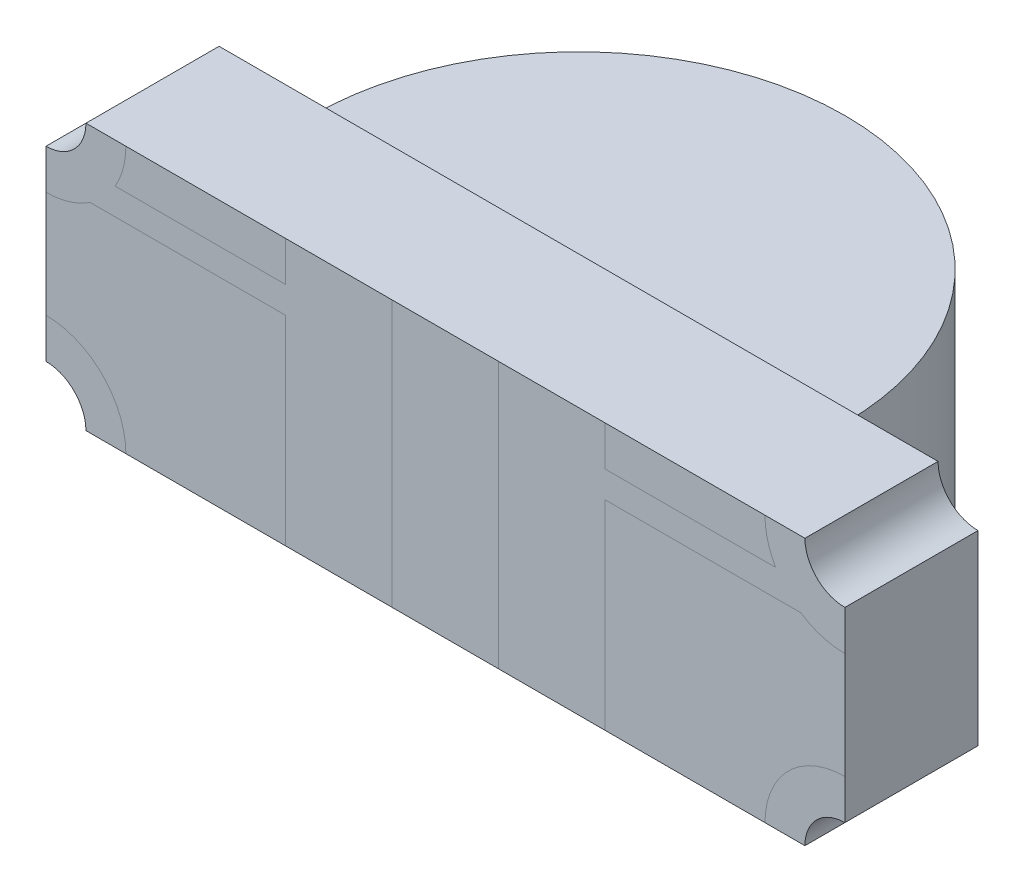
ISO-10303-21;
HEADER;
FILE_DESCRIPTION(('STEP AP214'),'2;1');
FILE_NAME('part.step','',(''),(''),'','','');
FILE_SCHEMA(('AUTOMOTIVE_DESIGN { 1 0 10303 214 1 1 1 1 }'));
ENDSEC;
DATA;
#1=APPLICATION_CONTEXT('core data for automotive mechanical design processes');
#2=APPLICATION_PROTOCOL_DEFINITION('international standard','automotive_design',2000,#1);
#3=PRODUCT_CONTEXT('',#1,'mechanical');
#4=PRODUCT('Part','Part','',(#3));
#5=PRODUCT_RELATED_PRODUCT_CATEGORY('part','',(#4));
#6=PRODUCT_DEFINITION_FORMATION('','',#4);
#7=PRODUCT_DEFINITION_CONTEXT('part definition',#1,'design');
#8=PRODUCT_DEFINITION('design','',#6,#7);
#9=PRODUCT_DEFINITION_SHAPE('','',#8);
#10=(LENGTH_UNIT() NAMED_UNIT(*) SI_UNIT(.MILLI.,.METRE.));
#11=(NAMED_UNIT(*) PLANE_ANGLE_UNIT() SI_UNIT($,.RADIAN.));
#12=(NAMED_UNIT(*) SI_UNIT($,.STERADIAN.) SOLID_ANGLE_UNIT());
#13=UNCERTAINTY_MEASURE_WITH_UNIT(LENGTH_MEASURE(1.E-05),#10,'distance_accuracy_value','');
#14=(GEOMETRIC_REPRESENTATION_CONTEXT(3) GLOBAL_UNCERTAINTY_ASSIGNED_CONTEXT((#13)) GLOBAL_UNIT_ASSIGNED_CONTEXT((#10,
#11,#12)) REPRESENTATION_CONTEXT('',''));
#15=CARTESIAN_POINT('',(0.,0.,0.));
#16=DIRECTION('',(0.,0.,1.));
#17=DIRECTION('',(1.,0.,0.));
#18=AXIS2_PLACEMENT_3D('',#15,#16,#17);
#19=CARTESIAN_POINT('',(0.,1.,-0.5));
#20=DIRECTION('',(0.,-1.,0.));
#21=DIRECTION('',(0.,0.,-1.));
#22=AXIS2_PLACEMENT_3D('',#19,#20,#21);
#23=CYLINDRICAL_SURFACE('',#22,1.);
#24=CARTESIAN_POINT('',(0.,0.95,-0.5));
#25=DIRECTION('',(0.,1.,0.));
#26=DIRECTION('',(0.,0.,1.));
#27=AXIS2_PLACEMENT_3D('',#24,#25,#26);
#28=CIRCLE('',#27,1.);
#29=CARTESIAN_POINT('',(1.,0.95,-0.5));
#30=VERTEX_POINT('',#29);
#31=CARTESIAN_POINT('',(-1.,0.95,-0.5));
#32=VERTEX_POINT('',#31);
#33=EDGE_CURVE('E183',#30,#32,#28,.T.);
#34=ORIENTED_EDGE('',*,*,#33,.F.);
#35=DIRECTION('',(0.,-1.,0.));
#36=VECTOR('',#35,1.);
#37=CARTESIAN_POINT('',(1.,1.,-0.5));
#38=LINE('',#37,#36);
#39=CARTESIAN_POINT('',(1.,0.,-0.5));
#40=VERTEX_POINT('',#39);
#41=EDGE_CURVE('E197',#30,#40,#38,.T.);
#42=ORIENTED_EDGE('',*,*,#41,.T.);
#43=CARTESIAN_POINT('',(0.,0.,-0.5));
#44=DIRECTION('',(0.,1.,0.));
#45=DIRECTION('',(0.,0.,1.));
#46=AXIS2_PLACEMENT_3D('',#43,#44,#45);
#47=CIRCLE('',#46,1.);
#48=CARTESIAN_POINT('',(-1.,0.,-0.5));
#49=VERTEX_POINT('',#48);
#50=EDGE_CURVE('E201',#40,#49,#47,.T.);
#51=ORIENTED_EDGE('',*,*,#50,.T.);
#52=DIRECTION('',(0.,-1.,0.));
#53=VECTOR('',#52,1.);
#54=CARTESIAN_POINT('',(-1.,1.,-0.5));
#55=LINE('',#54,#53);
#56=EDGE_CURVE('E194',#32,#49,#55,.T.);
#57=ORIENTED_EDGE('',*,*,#56,.F.);
#58=EDGE_LOOP('',(#34,#42,#51,#57));
#59=FACE_BOUND('',#58,.T.);
#60=ADVANCED_FACE('F37',(#59),#23,.T.);
#61=CARTESIAN_POINT('',(-1.5,1.,0.));
#62=DIRECTION('',(0.,0.,-1.));
#63=DIRECTION('',(-1.,0.,0.));
#64=AXIS2_PLACEMENT_3D('',#61,#62,#63);
#65=PLANE('',#64);
#66=CARTESIAN_POINT('',(1.5,1.,0.));
#67=DIRECTION('',(0.,0.,-1.));
#68=DIRECTION('',(-1.,0.,0.));
#69=AXIS2_PLACEMENT_3D('',#66,#67,#68);
#70=CIRCLE('',#69,0.3);
#71=CARTESIAN_POINT('',(1.2,1.,0.));
#72=VERTEX_POINT('',#71);
#73=CARTESIAN_POINT('',(1.24019237886467,0.85,0.));
#74=VERTEX_POINT('',#73);
#75=EDGE_CURVE('E11',#72,#74,#70,.F.);
#76=ORIENTED_EDGE('',*,*,#75,.F.);
#77=DIRECTION('',(1.,0.,0.));
#78=VECTOR('',#77,1.);
#79=CARTESIAN_POINT('',(-1.5,1.,0.));
#80=LINE('',#79,#78);
#81=CARTESIAN_POINT('',(0.6,1.,0.));
#82=VERTEX_POINT('',#81);
#83=EDGE_CURVE('E339',#82,#72,#80,.T.);
#84=ORIENTED_EDGE('',*,*,#83,.F.);
#85=DIRECTION('',(0.,1.,0.));
#86=VECTOR('',#85,1.);
#87=CARTESIAN_POINT('',(0.6,1.,0.));
#88=LINE('',#87,#86);
#89=CARTESIAN_POINT('',(0.6,0.85,0.));
#90=VERTEX_POINT('',#89);
#91=EDGE_CURVE('E273',#90,#82,#88,.T.);
#92=ORIENTED_EDGE('',*,*,#91,.F.);
#93=DIRECTION('',(-1.,0.,0.));
#94=VECTOR('',#93,1.);
#95=CARTESIAN_POINT('',(-1.5,0.85,0.));
#96=LINE('',#95,#94);
#97=EDGE_CURVE('E41',#74,#90,#96,.T.);
#98=ORIENTED_EDGE('',*,*,#97,.F.);
#99=EDGE_LOOP('',(#76,#84,#92,#98));
#100=FACE_BOUND('',#99,.T.);
#101=ADVANCED_FACE('F441',(#100),#65,.F.);
#102=DIRECTION('',(0.,-1.,0.));
#103=VECTOR('',#102,1.);
#104=CARTESIAN_POINT('',(0.2,1.,0.));
#105=LINE('',#104,#103);
#106=CARTESIAN_POINT('',(0.2,1.,0.));
#107=VERTEX_POINT('',#106);
#108=CARTESIAN_POINT('',(0.2,0.,0.));
#109=VERTEX_POINT('',#108);
#110=EDGE_CURVE('E271',#107,#109,#105,.T.);
#111=ORIENTED_EDGE('',*,*,#110,.F.);
#112=CARTESIAN_POINT('',(-0.2,1.,0.));
#113=VERTEX_POINT('',#112);
#114=EDGE_CURVE('E355',#113,#107,#80,.T.);
#115=ORIENTED_EDGE('',*,*,#114,.F.);
#116=DIRECTION('',(0.,1.,0.));
#117=VECTOR('',#116,1.);
#118=CARTESIAN_POINT('',(-0.2,1.,0.));
#119=LINE('',#118,#117);
#120=CARTESIAN_POINT('',(-0.2,0.,0.));
#121=VERTEX_POINT('',#120);
#122=EDGE_CURVE('E253',#121,#113,#119,.T.);
#123=ORIENTED_EDGE('',*,*,#122,.F.);
#124=DIRECTION('',(1.,0.,0.));
#125=VECTOR('',#124,1.);
#126=CARTESIAN_POINT('',(-1.5,0.,0.));
#127=LINE('',#126,#125);
#128=EDGE_CURVE('E325',#121,#109,#127,.T.);
#129=ORIENTED_EDGE('',*,*,#128,.T.);
#130=EDGE_LOOP('',(#111,#115,#123,#129));
#131=FACE_BOUND('',#130,.T.);
#132=ADVANCED_FACE('F366',(#131),#65,.F.);
#133=CARTESIAN_POINT('',(1.33416876048223,0.75,0.));
#134=VERTEX_POINT('',#133);
#135=CARTESIAN_POINT('',(1.5,0.7,0.));
#136=VERTEX_POINT('',#135);
#137=EDGE_CURVE('E48',#134,#136,#70,.F.);
#138=ORIENTED_EDGE('',*,*,#137,.F.);
#139=DIRECTION('',(1.,0.,0.));
#140=VECTOR('',#139,1.);
#141=CARTESIAN_POINT('',(-1.5,0.75,0.));
#142=LINE('',#141,#140);
#143=CARTESIAN_POINT('',(0.6,0.75,0.));
#144=VERTEX_POINT('',#143);
#145=EDGE_CURVE('E263',#144,#134,#142,.T.);
#146=ORIENTED_EDGE('',*,*,#145,.F.);
#147=DIRECTION('',(0.,1.,0.));
#148=VECTOR('',#147,1.);
#149=CARTESIAN_POINT('',(0.6,1.,0.));
#150=LINE('',#149,#148);
#151=CARTESIAN_POINT('',(0.6,0.,0.));
#152=VERTEX_POINT('',#151);
#153=EDGE_CURVE('E267',#152,#144,#150,.T.);
#154=ORIENTED_EDGE('',*,*,#153,.F.);
#155=CARTESIAN_POINT('',(1.2,0.,0.));
#156=VERTEX_POINT('',#155);
#157=EDGE_CURVE('E333',#152,#156,#127,.T.);
#158=ORIENTED_EDGE('',*,*,#157,.T.);
#159=CARTESIAN_POINT('',(1.5,0.,0.));
#160=DIRECTION('',(0.,0.,-1.));
#161=DIRECTION('',(-1.,0.,0.));
#162=AXIS2_PLACEMENT_3D('',#159,#160,#161);
#163=CIRCLE('',#162,0.3);
#164=CARTESIAN_POINT('',(1.5,0.3,0.));
#165=VERTEX_POINT('',#164);
#166=EDGE_CURVE('E235',#165,#156,#163,.F.);
#167=ORIENTED_EDGE('',*,*,#166,.F.);
#168=DIRECTION('',(0.,-1.,0.));
#169=VECTOR('',#168,1.);
#170=CARTESIAN_POINT('',(1.5,1.,0.));
#171=LINE('',#170,#169);
#172=EDGE_CURVE('E219',#136,#165,#171,.T.);
#173=ORIENTED_EDGE('',*,*,#172,.F.);
#174=EDGE_LOOP('',(#138,#146,#154,#158,#167,#173));
#175=FACE_BOUND('',#174,.T.);
#176=ADVANCED_FACE('F417',(#175),#65,.F.);
#177=CARTESIAN_POINT('',(-1.5,1.,0.));
#178=DIRECTION('',(0.,0.,-1.));
#179=DIRECTION('',(-1.,0.,0.));
#180=AXIS2_PLACEMENT_3D('',#177,#178,#179);
#181=CIRCLE('',#180,0.3);
#182=CARTESIAN_POINT('',(-1.5,0.699999999999999,0.));
#183=VERTEX_POINT('',#182);
#184=CARTESIAN_POINT('',(-1.33416876048223,0.75,0.));
#185=VERTEX_POINT('',#184);
#186=EDGE_CURVE('E254',#183,#185,#181,.F.);
#187=ORIENTED_EDGE('',*,*,#186,.F.);
#188=DIRECTION('',(0.,-1.,0.));
#189=VECTOR('',#188,1.);
#190=CARTESIAN_POINT('',(-1.5,1.,0.));
#191=LINE('',#190,#189);
#192=CARTESIAN_POINT('',(-1.5,0.3,0.));
#193=VERTEX_POINT('',#192);
#194=EDGE_CURVE('E224',#183,#193,#191,.T.);
#195=ORIENTED_EDGE('',*,*,#194,.T.);
#196=CARTESIAN_POINT('',(-1.5,0.,0.));
#197=DIRECTION('',(0.,0.,-1.));
#198=DIRECTION('',(-1.,0.,0.));
#199=AXIS2_PLACEMENT_3D('',#196,#197,#198);
#200=CIRCLE('',#199,0.3);
#201=CARTESIAN_POINT('',(-1.2,0.,0.));
#202=VERTEX_POINT('',#201);
#203=EDGE_CURVE('E239',#202,#193,#200,.F.);
#204=ORIENTED_EDGE('',*,*,#203,.F.);
#205=CARTESIAN_POINT('',(-0.6,0.,0.));
#206=VERTEX_POINT('',#205);
#207=EDGE_CURVE('E314',#202,#206,#127,.T.);
#208=ORIENTED_EDGE('',*,*,#207,.T.);
#209=DIRECTION('',(0.,-1.,0.));
#210=VECTOR('',#209,1.);
#211=CARTESIAN_POINT('',(-0.600000000000001,1.,0.));
#212=LINE('',#211,#210);
#213=CARTESIAN_POINT('',(-0.600000000000001,0.75,0.));
#214=VERTEX_POINT('',#213);
#215=EDGE_CURVE('E257',#214,#206,#212,.T.);
#216=ORIENTED_EDGE('',*,*,#215,.F.);
#217=DIRECTION('',(1.,0.,0.));
#218=VECTOR('',#217,1.);
#219=CARTESIAN_POINT('',(-1.5,0.75,0.));
#220=LINE('',#219,#218);
#221=EDGE_CURVE('E260',#185,#214,#220,.T.);
#222=ORIENTED_EDGE('',*,*,#221,.F.);
#223=EDGE_LOOP('',(#187,#195,#204,#208,#216,#222));
#224=FACE_BOUND('',#223,.T.);
#225=ADVANCED_FACE('F311',(#224),#65,.F.);
#226=CARTESIAN_POINT('',(1.35,1.,0.));
#227=VERTEX_POINT('',#226);
#228=EDGE_CURVE('E337',#72,#227,#80,.T.);
#229=ORIENTED_EDGE('',*,*,#228,.F.);
#230=ORIENTED_EDGE('',*,*,#75,.T.);
#231=ORIENTED_EDGE('',*,*,#97,.T.);
#232=ORIENTED_EDGE('',*,*,#91,.T.);
#233=EDGE_CURVE('E344',#107,#82,#80,.T.);
#234=ORIENTED_EDGE('',*,*,#233,.F.);
#235=ORIENTED_EDGE('',*,*,#110,.T.);
#236=EDGE_CURVE('E329',#109,#152,#127,.T.);
#237=ORIENTED_EDGE('',*,*,#236,.T.);
#238=ORIENTED_EDGE('',*,*,#153,.T.);
#239=ORIENTED_EDGE('',*,*,#145,.T.);
#240=ORIENTED_EDGE('',*,*,#137,.T.);
#241=CARTESIAN_POINT('',(1.5,0.85,0.));
#242=VERTEX_POINT('',#241);
#243=EDGE_CURVE('E215',#242,#136,#171,.T.);
#244=ORIENTED_EDGE('',*,*,#243,.F.);
#245=CARTESIAN_POINT('',(1.5,1.,0.));
#246=DIRECTION('',(0.,0.,1.));
#247=DIRECTION('',(1.,0.,0.));
#248=AXIS2_PLACEMENT_3D('',#245,#246,#247);
#249=CIRCLE('',#248,0.15);
#250=EDGE_CURVE('E404',#227,#242,#249,.T.);
#251=ORIENTED_EDGE('',*,*,#250,.F.);
#252=EDGE_LOOP('',(#229,#230,#231,#232,#234,#235,#237,#238,#239,#240,#244,#251));
#253=FACE_BOUND('',#252,.T.);
#254=ADVANCED_FACE('F361',(#253),#65,.F.);
#255=CARTESIAN_POINT('',(-1.24019237886467,0.85,0.));
#256=VERTEX_POINT('',#255);
#257=CARTESIAN_POINT('',(-1.2,1.,0.));
#258=VERTEX_POINT('',#257);
#259=EDGE_CURVE('E250',#256,#258,#181,.F.);
#260=ORIENTED_EDGE('',*,*,#259,.F.);
#261=DIRECTION('',(-1.,0.,0.));
#262=VECTOR('',#261,1.);
#263=CARTESIAN_POINT('',(-1.5,0.85,0.));
#264=LINE('',#263,#262);
#265=CARTESIAN_POINT('',(-0.6,0.85,0.));
#266=VERTEX_POINT('',#265);
#267=EDGE_CURVE('E243',#266,#256,#264,.T.);
#268=ORIENTED_EDGE('',*,*,#267,.F.);
#269=DIRECTION('',(0.,-1.,0.));
#270=VECTOR('',#269,1.);
#271=CARTESIAN_POINT('',(-0.6,1.,0.));
#272=LINE('',#271,#270);
#273=CARTESIAN_POINT('',(-0.6,1.,0.));
#274=VERTEX_POINT('',#273);
#275=EDGE_CURVE('E247',#274,#266,#272,.T.);
#276=ORIENTED_EDGE('',*,*,#275,.F.);
#277=EDGE_CURVE('E347',#258,#274,#80,.T.);
#278=ORIENTED_EDGE('',*,*,#277,.F.);
#279=EDGE_LOOP('',(#260,#268,#276,#278));
#280=FACE_BOUND('',#279,.T.);
#281=ADVANCED_FACE('F369',(#280),#65,.F.);
#282=CARTESIAN_POINT('',(-1.5,0.85,0.));
#283=VERTEX_POINT('',#282);
#284=EDGE_CURVE('E220',#283,#183,#191,.T.);
#285=ORIENTED_EDGE('',*,*,#284,.T.);
#286=ORIENTED_EDGE('',*,*,#186,.T.);
#287=ORIENTED_EDGE('',*,*,#221,.T.);
#288=ORIENTED_EDGE('',*,*,#215,.T.);
#289=EDGE_CURVE('E317',#206,#121,#127,.T.);
#290=ORIENTED_EDGE('',*,*,#289,.T.);
#291=ORIENTED_EDGE('',*,*,#122,.T.);
#292=EDGE_CURVE('E352',#274,#113,#80,.T.);
#293=ORIENTED_EDGE('',*,*,#292,.F.);
#294=ORIENTED_EDGE('',*,*,#275,.T.);
#295=ORIENTED_EDGE('',*,*,#267,.T.);
#296=ORIENTED_EDGE('',*,*,#259,.T.);
#297=CARTESIAN_POINT('',(-1.35,1.,0.));
#298=VERTEX_POINT('',#297);
#299=EDGE_CURVE('E340',#298,#258,#80,.T.);
#300=ORIENTED_EDGE('',*,*,#299,.F.);
#301=CARTESIAN_POINT('',(-1.5,1.,0.));
#302=DIRECTION('',(0.,0.,1.));
#303=DIRECTION('',(1.,0.,0.));
#304=AXIS2_PLACEMENT_3D('',#301,#302,#303);
#305=CIRCLE('',#304,0.15);
#306=EDGE_CURVE('E370',#283,#298,#305,.T.);
#307=ORIENTED_EDGE('',*,*,#306,.F.);
#308=EDGE_LOOP('',(#285,#286,#287,#288,#290,#291,#293,#294,#295,#296,#300,#307));
#309=FACE_BOUND('',#308,.T.);
#310=ADVANCED_FACE('F305',(#309),#65,.F.);
#311=CARTESIAN_POINT('',(-1.35,0.,0.));
#312=VERTEX_POINT('',#311);
#313=EDGE_CURVE('E327',#312,#202,#127,.T.);
#314=ORIENTED_EDGE('',*,*,#313,.T.);
#315=ORIENTED_EDGE('',*,*,#203,.T.);
#316=CARTESIAN_POINT('',(-1.5,0.15,0.));
#317=VERTEX_POINT('',#316);
#318=EDGE_CURVE('E218',#193,#317,#191,.T.);
#319=ORIENTED_EDGE('',*,*,#318,.T.);
#320=CARTESIAN_POINT('',(-1.5,0.,0.));
#321=DIRECTION('',(0.,0.,1.));
#322=DIRECTION('',(1.,0.,0.));
#323=AXIS2_PLACEMENT_3D('',#320,#321,#322);
#324=CIRCLE('',#323,0.15);
#325=EDGE_CURVE('E198',#312,#317,#324,.T.);
#326=ORIENTED_EDGE('',*,*,#325,.F.);
#327=EDGE_LOOP('',(#314,#315,#319,#326));
#328=FACE_BOUND('',#327,.T.);
#329=ADVANCED_FACE('F384',(#328),#65,.F.);
#330=CARTESIAN_POINT('',(-1.5,1.,-0.5));
#331=DIRECTION('',(1.,0.,0.));
#332=DIRECTION('',(0.,0.,-1.));
#333=AXIS2_PLACEMENT_3D('',#330,#331,#332);
#334=PLANE('',#333);
#335=DIRECTION('',(0.,-1.,0.));
#336=VECTOR('',#335,1.);
#337=CARTESIAN_POINT('',(-1.5,1.,-0.5));
#338=LINE('',#337,#336);
#339=CARTESIAN_POINT('',(-1.5,0.85,-0.5));
#340=VERTEX_POINT('',#339);
#341=CARTESIAN_POINT('',(-1.5,0.15,-0.5));
#342=VERTEX_POINT('',#341);
#343=EDGE_CURVE('E203',#340,#342,#338,.T.);
#344=ORIENTED_EDGE('',*,*,#343,.T.);
#345=DIRECTION('',(0.,0.,1.));
#346=VECTOR('',#345,1.);
#347=CARTESIAN_POINT('',(-1.5,0.15,-1.5));
#348=LINE('',#347,#346);
#349=EDGE_CURVE('E373',#342,#317,#348,.T.);
#350=ORIENTED_EDGE('',*,*,#349,.T.);
#351=ORIENTED_EDGE('',*,*,#318,.F.);
#352=ORIENTED_EDGE('',*,*,#194,.F.);
#353=ORIENTED_EDGE('',*,*,#284,.F.);
#354=DIRECTION('',(0.,0.,1.));
#355=VECTOR('',#354,1.);
#356=CARTESIAN_POINT('',(-1.5,0.85,-1.5));
#357=LINE('',#356,#355);
#358=EDGE_CURVE('E377',#283,#340,#357,.F.);
#359=ORIENTED_EDGE('',*,*,#358,.T.);
#360=EDGE_LOOP('',(#344,#350,#351,#352,#353,#359));
#361=FACE_BOUND('',#360,.T.);
#362=ADVANCED_FACE('F39',(#361),#334,.F.);
#363=CARTESIAN_POINT('',(1.5,0.15,0.));
#364=VERTEX_POINT('',#363);
#365=EDGE_CURVE('E214',#165,#364,#171,.T.);
#366=ORIENTED_EDGE('',*,*,#365,.F.);
#367=ORIENTED_EDGE('',*,*,#166,.T.);
#368=CARTESIAN_POINT('',(1.35,0.,0.));
#369=VERTEX_POINT('',#368);
#370=EDGE_CURVE('E328',#156,#369,#127,.T.);
#371=ORIENTED_EDGE('',*,*,#370,.T.);
#372=CARTESIAN_POINT('',(1.5,0.,0.));
#373=DIRECTION('',(0.,0.,1.));
#374=DIRECTION('',(1.,0.,0.));
#375=AXIS2_PLACEMENT_3D('',#372,#373,#374);
#376=CIRCLE('',#375,0.15);
#377=EDGE_CURVE('E395',#364,#369,#376,.T.);
#378=ORIENTED_EDGE('',*,*,#377,.F.);
#379=EDGE_LOOP('',(#366,#367,#371,#378));
#380=FACE_BOUND('',#379,.T.);
#381=ADVANCED_FACE('F421',(#380),#65,.F.);
#382=CARTESIAN_POINT('',(1.5,1.,-0.5));
#383=DIRECTION('',(-1.,0.,0.));
#384=DIRECTION('',(0.,0.,1.));
#385=AXIS2_PLACEMENT_3D('',#382,#383,#384);
#386=PLANE('',#385);
#387=ORIENTED_EDGE('',*,*,#243,.T.);
#388=ORIENTED_EDGE('',*,*,#172,.T.);
#389=ORIENTED_EDGE('',*,*,#365,.T.);
#390=DIRECTION('',(0.,0.,1.));
#391=VECTOR('',#390,1.);
#392=CARTESIAN_POINT('',(1.5,0.15,-1.5));
#393=LINE('',#392,#391);
#394=CARTESIAN_POINT('',(1.5,0.15,-0.5));
#395=VERTEX_POINT('',#394);
#396=EDGE_CURVE('E401',#364,#395,#393,.F.);
#397=ORIENTED_EDGE('',*,*,#396,.T.);
#398=DIRECTION('',(0.,-1.,0.));
#399=VECTOR('',#398,1.);
#400=CARTESIAN_POINT('',(1.5,1.,-0.5));
#401=LINE('',#400,#399);
#402=CARTESIAN_POINT('',(1.5,0.85,-0.5));
#403=VERTEX_POINT('',#402);
#404=EDGE_CURVE('E205',#403,#395,#401,.T.);
#405=ORIENTED_EDGE('',*,*,#404,.F.);
#406=DIRECTION('',(0.,0.,1.));
#407=VECTOR('',#406,1.);
#408=CARTESIAN_POINT('',(1.5,0.85,-1.5));
#409=LINE('',#408,#407);
#410=EDGE_CURVE('E408',#403,#242,#409,.T.);
#411=ORIENTED_EDGE('',*,*,#410,.T.);
#412=EDGE_LOOP('',(#387,#388,#389,#397,#405,#411));
#413=FACE_BOUND('',#412,.T.);
#414=ADVANCED_FACE('F427',(#413),#386,.F.);
#415=CARTESIAN_POINT('',(-1.5,1.,-0.5));
#416=DIRECTION('',(0.,0.,1.));
#417=DIRECTION('',(1.,0.,0.));
#418=AXIS2_PLACEMENT_3D('',#415,#416,#417);
#419=PLANE('',#418);
#420=DIRECTION('',(-1.,0.,0.));
#421=VECTOR('',#420,1.);
#422=CARTESIAN_POINT('',(-1.5,0.,-0.5));
#423=LINE('',#422,#421);
#424=CARTESIAN_POINT('',(-1.35,0.,-0.5));
#425=VERTEX_POINT('',#424);
#426=EDGE_CURVE('E336',#49,#425,#423,.T.);
#427=ORIENTED_EDGE('',*,*,#426,.T.);
#428=CARTESIAN_POINT('',(-1.5,0.,-0.5));
#429=DIRECTION('',(0.,0.,1.));
#430=DIRECTION('',(1.,0.,0.));
#431=AXIS2_PLACEMENT_3D('',#428,#429,#430);
#432=CIRCLE('',#431,0.15);
#433=EDGE_CURVE('E387',#425,#342,#432,.T.);
#434=ORIENTED_EDGE('',*,*,#433,.T.);
#435=ORIENTED_EDGE('',*,*,#343,.F.);
#436=CARTESIAN_POINT('',(-1.5,1.,-0.5));
#437=DIRECTION('',(0.,0.,1.));
#438=DIRECTION('',(1.,0.,0.));
#439=AXIS2_PLACEMENT_3D('',#436,#437,#438);
#440=CIRCLE('',#439,0.15);
#441=CARTESIAN_POINT('',(-1.35,1.,-0.5));
#442=VERTEX_POINT('',#441);
#443=EDGE_CURVE('E372',#340,#442,#440,.T.);
#444=ORIENTED_EDGE('',*,*,#443,.T.);
#445=DIRECTION('',(-1.,0.,0.));
#446=VECTOR('',#445,1.);
#447=CARTESIAN_POINT('',(-1.5,1.,-0.5));
#448=LINE('',#447,#446);
#449=CARTESIAN_POINT('',(1.35,1.,-0.5));
#450=VERTEX_POINT('',#449);
#451=EDGE_CURVE('E208',#450,#442,#448,.T.);
#452=ORIENTED_EDGE('',*,*,#451,.F.);
#453=CARTESIAN_POINT('',(1.5,1.,-0.5));
#454=DIRECTION('',(0.,0.,1.));
#455=DIRECTION('',(1.,0.,0.));
#456=AXIS2_PLACEMENT_3D('',#453,#454,#455);
#457=CIRCLE('',#456,0.15);
#458=EDGE_CURVE('E406',#450,#403,#457,.T.);
#459=ORIENTED_EDGE('',*,*,#458,.T.);
#460=ORIENTED_EDGE('',*,*,#404,.T.);
#461=CARTESIAN_POINT('',(1.5,0.,-0.5));
#462=DIRECTION('',(0.,0.,1.));
#463=DIRECTION('',(1.,0.,0.));
#464=AXIS2_PLACEMENT_3D('',#461,#462,#463);
#465=CIRCLE('',#464,0.15);
#466=CARTESIAN_POINT('',(1.35,0.,-0.5));
#467=VERTEX_POINT('',#466);
#468=EDGE_CURVE('E398',#395,#467,#465,.T.);
#469=ORIENTED_EDGE('',*,*,#468,.T.);
#470=DIRECTION('',(-1.,0.,0.));
#471=VECTOR('',#470,1.);
#472=CARTESIAN_POINT('',(1.,0.,-0.5));
#473=LINE('',#472,#471);
#474=EDGE_CURVE('E332',#467,#40,#473,.T.);
#475=ORIENTED_EDGE('',*,*,#474,.T.);
#476=ORIENTED_EDGE('',*,*,#41,.F.);
#477=DIRECTION('',(1.,0.,0.));
#478=VECTOR('',#477,1.);
#479=CARTESIAN_POINT('',(1.,0.95,-0.5));
#480=LINE('',#479,#478);
#481=EDGE_CURVE('E186',#32,#30,#480,.T.);
#482=ORIENTED_EDGE('',*,*,#481,.F.);
#483=ORIENTED_EDGE('',*,*,#56,.T.);
#484=EDGE_LOOP('',(#427,#434,#435,#444,#452,#459,#460,#469,#475,#476,#482,#483));
#485=FACE_BOUND('',#484,.T.);
#486=ADVANCED_FACE('F193',(#485),#419,.F.);
#487=CARTESIAN_POINT('',(0.,1.,-0.5));
#488=DIRECTION('',(0.,1.,0.));
#489=DIRECTION('',(0.,0.,1.));
#490=AXIS2_PLACEMENT_3D('',#487,#488,#489);
#491=PLANE('',#490);
#492=DIRECTION('',(0.,0.,1.));
#493=VECTOR('',#492,1.);
#494=CARTESIAN_POINT('',(1.35,1.,-1.5));
#495=LINE('',#494,#493);
#496=EDGE_CURVE('E223',#450,#227,#495,.T.);
#497=ORIENTED_EDGE('',*,*,#496,.F.);
#498=ORIENTED_EDGE('',*,*,#451,.T.);
#499=DIRECTION('',(0.,0.,1.));
#500=VECTOR('',#499,1.);
#501=CARTESIAN_POINT('',(-1.35,1.,-1.5));
#502=LINE('',#501,#500);
#503=EDGE_CURVE('E230',#298,#442,#502,.F.);
#504=ORIENTED_EDGE('',*,*,#503,.F.);
#505=ORIENTED_EDGE('',*,*,#299,.T.);
#506=ORIENTED_EDGE('',*,*,#277,.T.);
#507=ORIENTED_EDGE('',*,*,#292,.T.);
#508=ORIENTED_EDGE('',*,*,#114,.T.);
#509=ORIENTED_EDGE('',*,*,#233,.T.);
#510=ORIENTED_EDGE('',*,*,#83,.T.);
#511=ORIENTED_EDGE('',*,*,#228,.T.);
#512=EDGE_LOOP('',(#497,#498,#504,#505,#506,#507,#508,#509,#510,#511));
#513=FACE_BOUND('',#512,.T.);
#514=ADVANCED_FACE('F360',(#513),#491,.T.);
#515=CARTESIAN_POINT('',(0.,0.,-0.5));
#516=DIRECTION('',(0.,1.,0.));
#517=DIRECTION('',(0.,0.,1.));
#518=AXIS2_PLACEMENT_3D('',#515,#516,#517);
#519=PLANE('',#518);
#520=ORIENTED_EDGE('',*,*,#313,.F.);
#521=DIRECTION('',(0.,0.,1.));
#522=VECTOR('',#521,1.);
#523=CARTESIAN_POINT('',(-1.35,0.,-1.5));
#524=LINE('',#523,#522);
#525=EDGE_CURVE('E232',#312,#425,#524,.F.);
#526=ORIENTED_EDGE('',*,*,#525,.T.);
#527=ORIENTED_EDGE('',*,*,#426,.F.);
#528=ORIENTED_EDGE('',*,*,#50,.F.);
#529=ORIENTED_EDGE('',*,*,#474,.F.);
#530=DIRECTION('',(0.,0.,1.));
#531=VECTOR('',#530,1.);
#532=CARTESIAN_POINT('',(1.35,0.,-1.5));
#533=LINE('',#532,#531);
#534=EDGE_CURVE('E227',#467,#369,#533,.T.);
#535=ORIENTED_EDGE('',*,*,#534,.T.);
#536=ORIENTED_EDGE('',*,*,#370,.F.);
#537=ORIENTED_EDGE('',*,*,#157,.F.);
#538=ORIENTED_EDGE('',*,*,#236,.F.);
#539=ORIENTED_EDGE('',*,*,#128,.F.);
#540=ORIENTED_EDGE('',*,*,#289,.F.);
#541=ORIENTED_EDGE('',*,*,#207,.F.);
#542=EDGE_LOOP('',(#520,#526,#527,#528,#529,#535,#536,#537,#538,#539,#540,#541));
#543=FACE_BOUND('',#542,.T.);
#544=ADVANCED_FACE('F321',(#543),#519,.F.);
#545=CARTESIAN_POINT('',(1.5,1.,-1.5));
#546=DIRECTION('',(0.,0.,1.));
#547=DIRECTION('',(1.,0.,0.));
#548=AXIS2_PLACEMENT_3D('',#545,#546,#547);
#549=CYLINDRICAL_SURFACE('',#548,0.15);
#550=ORIENTED_EDGE('',*,*,#458,.F.);
#551=ORIENTED_EDGE('',*,*,#496,.T.);
#552=ORIENTED_EDGE('',*,*,#250,.T.);
#553=ORIENTED_EDGE('',*,*,#410,.F.);
#554=EDGE_LOOP('',(#550,#551,#552,#553));
#555=FACE_BOUND('',#554,.T.);
#556=ADVANCED_FACE('F430',(#555),#549,.F.);
#557=CARTESIAN_POINT('',(1.5,0.,-1.5));
#558=DIRECTION('',(0.,0.,1.));
#559=DIRECTION('',(1.,0.,0.));
#560=AXIS2_PLACEMENT_3D('',#557,#558,#559);
#561=CYLINDRICAL_SURFACE('',#560,0.15);
#562=ORIENTED_EDGE('',*,*,#377,.T.);
#563=ORIENTED_EDGE('',*,*,#534,.F.);
#564=ORIENTED_EDGE('',*,*,#468,.F.);
#565=ORIENTED_EDGE('',*,*,#396,.F.);
#566=EDGE_LOOP('',(#562,#563,#564,#565));
#567=FACE_BOUND('',#566,.T.);
#568=ADVANCED_FACE('F424',(#567),#561,.F.);
#569=CARTESIAN_POINT('',(-1.5,1.,-1.5));
#570=DIRECTION('',(0.,0.,1.));
#571=DIRECTION('',(1.,0.,0.));
#572=AXIS2_PLACEMENT_3D('',#569,#570,#571);
#573=CYLINDRICAL_SURFACE('',#572,0.15);
#574=ORIENTED_EDGE('',*,*,#306,.T.);
#575=ORIENTED_EDGE('',*,*,#503,.T.);
#576=ORIENTED_EDGE('',*,*,#443,.F.);
#577=ORIENTED_EDGE('',*,*,#358,.F.);
#578=EDGE_LOOP('',(#574,#575,#576,#577));
#579=FACE_BOUND('',#578,.T.);
#580=ADVANCED_FACE('F431',(#579),#573,.F.);
#581=CARTESIAN_POINT('',(-1.5,0.,-1.5));
#582=DIRECTION('',(0.,0.,1.));
#583=DIRECTION('',(1.,0.,0.));
#584=AXIS2_PLACEMENT_3D('',#581,#582,#583);
#585=CYLINDRICAL_SURFACE('',#584,0.15);
#586=ORIENTED_EDGE('',*,*,#433,.F.);
#587=ORIENTED_EDGE('',*,*,#525,.F.);
#588=ORIENTED_EDGE('',*,*,#325,.T.);
#589=ORIENTED_EDGE('',*,*,#349,.F.);
#590=EDGE_LOOP('',(#586,#587,#588,#589));
#591=FACE_BOUND('',#590,.T.);
#592=ADVANCED_FACE('F386',(#591),#585,.F.);
#593=CARTESIAN_POINT('',(0.,0.95,-0.5));
#594=DIRECTION('',(0.,1.,0.));
#595=DIRECTION('',(0.,0.,1.));
#596=AXIS2_PLACEMENT_3D('',#593,#594,#595);
#597=PLANE('',#596);
#598=ORIENTED_EDGE('',*,*,#33,.T.);
#599=ORIENTED_EDGE('',*,*,#481,.T.);
#600=EDGE_LOOP('',(#598,#599));
#601=FACE_BOUND('',#600,.T.);
#602=ADVANCED_FACE('F185',(#601),#597,.T.);
#603=CLOSED_SHELL('',(#60,#101,#132,#176,#225,#254,#281,#310,#329,#362,#381,#414,#486,#514,#544,
#556,#568,#580,#592,#602));
#604=MANIFOLD_SOLID_BREP('B2',#603);
#605=ADVANCED_BREP_SHAPE_REPRESENTATION('',(#18,#604),#14);
#606=SHAPE_DEFINITION_REPRESENTATION(#9,#605);
ENDSEC;
END-ISO-10303-21;
